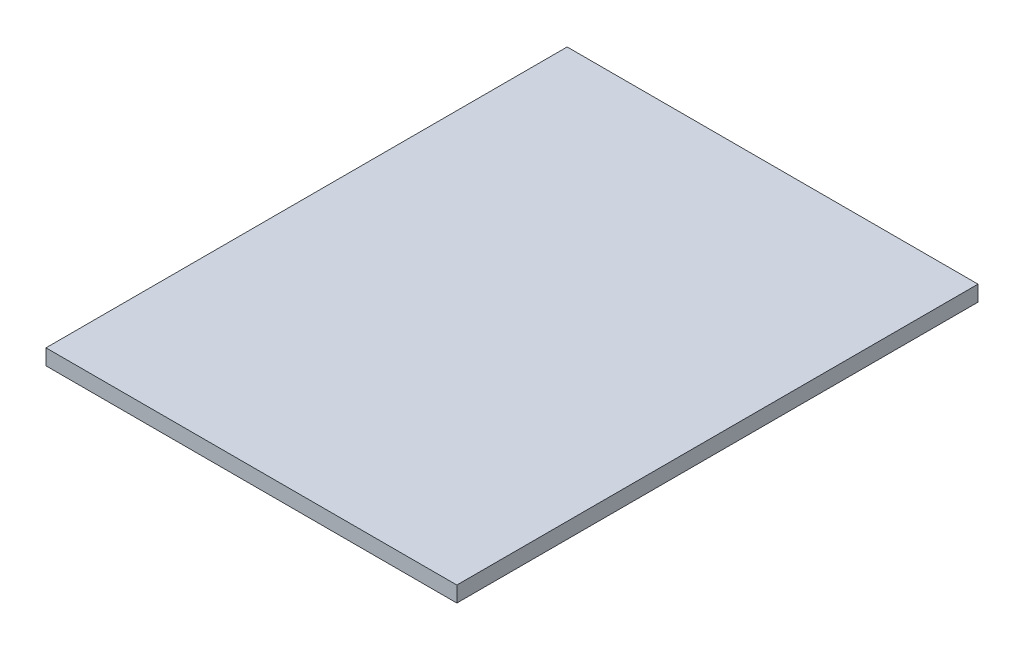
ISO-10303-21;
HEADER;
FILE_DESCRIPTION(('STEP AP214'),'2;1');
FILE_NAME('part.step','',(''),(''),'','','');
FILE_SCHEMA(('AUTOMOTIVE_DESIGN { 1 0 10303 214 1 1 1 1 }'));
ENDSEC;
DATA;
#1=APPLICATION_CONTEXT('core data for automotive mechanical design processes');
#2=APPLICATION_PROTOCOL_DEFINITION('international standard','automotive_design',2000,#1);
#3=PRODUCT_CONTEXT('',#1,'mechanical');
#4=PRODUCT('Part','Part','',(#3));
#5=PRODUCT_RELATED_PRODUCT_CATEGORY('part','',(#4));
#6=PRODUCT_DEFINITION_FORMATION('','',#4);
#7=PRODUCT_DEFINITION_CONTEXT('part definition',#1,'design');
#8=PRODUCT_DEFINITION('design','',#6,#7);
#9=PRODUCT_DEFINITION_SHAPE('','',#8);
#10=(LENGTH_UNIT() NAMED_UNIT(*) SI_UNIT(.MILLI.,.METRE.));
#11=(NAMED_UNIT(*) PLANE_ANGLE_UNIT() SI_UNIT($,.RADIAN.));
#12=(NAMED_UNIT(*) SI_UNIT($,.STERADIAN.) SOLID_ANGLE_UNIT());
#13=UNCERTAINTY_MEASURE_WITH_UNIT(LENGTH_MEASURE(1.E-05),#10,'distance_accuracy_value','');
#14=(GEOMETRIC_REPRESENTATION_CONTEXT(3) GLOBAL_UNCERTAINTY_ASSIGNED_CONTEXT((#13)) GLOBAL_UNIT_ASSIGNED_CONTEXT((#10,
#11,#12)) REPRESENTATION_CONTEXT('',''));
#15=CARTESIAN_POINT('',(0.,0.,0.));
#16=DIRECTION('',(0.,0.,1.));
#17=DIRECTION('',(1.,0.,0.));
#18=AXIS2_PLACEMENT_3D('',#15,#16,#17);
#19=CARTESIAN_POINT('',(0.,18.,0.));
#20=DIRECTION('',(1.,0.,0.));
#21=DIRECTION('',(0.,0.,-1.));
#22=AXIS2_PLACEMENT_3D('',#19,#20,#21);
#23=PLANE('',#22);
#24=DIRECTION('',(0.,0.,1.));
#25=VECTOR('',#24,1.);
#26=CARTESIAN_POINT('',(0.,0.,0.));
#27=LINE('',#26,#25);
#28=CARTESIAN_POINT('',(0.,0.,-600.));
#29=VERTEX_POINT('',#28);
#30=CARTESIAN_POINT('',(0.,0.,0.));
#31=VERTEX_POINT('',#30);
#32=EDGE_CURVE('E98',#29,#31,#27,.T.);
#33=ORIENTED_EDGE('',*,*,#32,.T.);
#34=DIRECTION('',(0.,-1.,0.));
#35=VECTOR('',#34,1.);
#36=CARTESIAN_POINT('',(0.,18.,0.));
#37=LINE('',#36,#35);
#38=CARTESIAN_POINT('',(0.,18.,0.));
#39=VERTEX_POINT('',#38);
#40=EDGE_CURVE('E11',#39,#31,#37,.T.);
#41=ORIENTED_EDGE('',*,*,#40,.F.);
#42=DIRECTION('',(0.,0.,1.));
#43=VECTOR('',#42,1.);
#44=CARTESIAN_POINT('',(0.,18.,0.));
#45=LINE('',#44,#43);
#46=CARTESIAN_POINT('',(0.,18.,-600.));
#47=VERTEX_POINT('',#46);
#48=EDGE_CURVE('E86',#47,#39,#45,.T.);
#49=ORIENTED_EDGE('',*,*,#48,.F.);
#50=DIRECTION('',(0.,-1.,0.));
#51=VECTOR('',#50,1.);
#52=CARTESIAN_POINT('',(0.,18.,-600.));
#53=LINE('',#52,#51);
#54=EDGE_CURVE('E94',#47,#29,#53,.T.);
#55=ORIENTED_EDGE('',*,*,#54,.T.);
#56=EDGE_LOOP('',(#33,#41,#49,#55));
#57=FACE_BOUND('',#56,.T.);
#58=ADVANCED_FACE('F35',(#57),#23,.F.);
#59=CARTESIAN_POINT('',(0.,18.,0.));
#60=DIRECTION('',(0.,0.,-1.));
#61=DIRECTION('',(-1.,0.,0.));
#62=AXIS2_PLACEMENT_3D('',#59,#60,#61);
#63=PLANE('',#62);
#64=DIRECTION('',(1.,0.,0.));
#65=VECTOR('',#64,1.);
#66=CARTESIAN_POINT('',(0.,0.,0.));
#67=LINE('',#66,#65);
#68=CARTESIAN_POINT('',(473.,0.,0.));
#69=VERTEX_POINT('',#68);
#70=EDGE_CURVE('E90',#31,#69,#67,.T.);
#71=ORIENTED_EDGE('',*,*,#70,.T.);
#72=DIRECTION('',(0.,-1.,0.));
#73=VECTOR('',#72,1.);
#74=CARTESIAN_POINT('',(473.,18.,0.));
#75=LINE('',#74,#73);
#76=CARTESIAN_POINT('',(473.,18.,0.));
#77=VERTEX_POINT('',#76);
#78=EDGE_CURVE('E43',#77,#69,#75,.T.);
#79=ORIENTED_EDGE('',*,*,#78,.F.);
#80=DIRECTION('',(1.,0.,0.));
#81=VECTOR('',#80,1.);
#82=CARTESIAN_POINT('',(0.,18.,0.));
#83=LINE('',#82,#81);
#84=EDGE_CURVE('E81',#39,#77,#83,.T.);
#85=ORIENTED_EDGE('',*,*,#84,.F.);
#86=ORIENTED_EDGE('',*,*,#40,.T.);
#87=EDGE_LOOP('',(#71,#79,#85,#86));
#88=FACE_BOUND('',#87,.T.);
#89=ADVANCED_FACE('F89',(#88),#63,.F.);
#90=CARTESIAN_POINT('',(473.,18.,0.));
#91=DIRECTION('',(-1.,0.,0.));
#92=DIRECTION('',(0.,0.,1.));
#93=AXIS2_PLACEMENT_3D('',#90,#91,#92);
#94=PLANE('',#93);
#95=DIRECTION('',(0.,0.,-1.));
#96=VECTOR('',#95,1.);
#97=CARTESIAN_POINT('',(473.,0.,0.));
#98=LINE('',#97,#96);
#99=CARTESIAN_POINT('',(473.,0.,-600.));
#100=VERTEX_POINT('',#99);
#101=EDGE_CURVE('E68',#69,#100,#98,.T.);
#102=ORIENTED_EDGE('',*,*,#101,.T.);
#103=DIRECTION('',(0.,-1.,0.));
#104=VECTOR('',#103,1.);
#105=CARTESIAN_POINT('',(473.,18.,-600.));
#106=LINE('',#105,#104);
#107=CARTESIAN_POINT('',(473.,18.,-600.));
#108=VERTEX_POINT('',#107);
#109=EDGE_CURVE('E91',#108,#100,#106,.T.);
#110=ORIENTED_EDGE('',*,*,#109,.F.);
#111=DIRECTION('',(0.,0.,-1.));
#112=VECTOR('',#111,1.);
#113=CARTESIAN_POINT('',(473.,18.,0.));
#114=LINE('',#113,#112);
#115=EDGE_CURVE('E84',#77,#108,#114,.T.);
#116=ORIENTED_EDGE('',*,*,#115,.F.);
#117=ORIENTED_EDGE('',*,*,#78,.T.);
#118=EDGE_LOOP('',(#102,#110,#116,#117));
#119=FACE_BOUND('',#118,.T.);
#120=ADVANCED_FACE('F92',(#119),#94,.F.);
#121=CARTESIAN_POINT('',(0.,18.,-600.));
#122=DIRECTION('',(0.,0.,1.));
#123=DIRECTION('',(1.,0.,0.));
#124=AXIS2_PLACEMENT_3D('',#121,#122,#123);
#125=PLANE('',#124);
#126=DIRECTION('',(-1.,0.,0.));
#127=VECTOR('',#126,1.);
#128=CARTESIAN_POINT('',(0.,0.,-600.));
#129=LINE('',#128,#127);
#130=EDGE_CURVE('E74',#100,#29,#129,.T.);
#131=ORIENTED_EDGE('',*,*,#130,.T.);
#132=ORIENTED_EDGE('',*,*,#54,.F.);
#133=DIRECTION('',(-1.,0.,0.));
#134=VECTOR('',#133,1.);
#135=CARTESIAN_POINT('',(0.,18.,-600.));
#136=LINE('',#135,#134);
#137=EDGE_CURVE('E51',#108,#47,#136,.T.);
#138=ORIENTED_EDGE('',*,*,#137,.F.);
#139=ORIENTED_EDGE('',*,*,#109,.T.);
#140=EDGE_LOOP('',(#131,#132,#138,#139));
#141=FACE_BOUND('',#140,.T.);
#142=ADVANCED_FACE('F105',(#141),#125,.F.);
#143=CARTESIAN_POINT('',(0.,18.,0.));
#144=DIRECTION('',(0.,-1.,0.));
#145=DIRECTION('',(0.,0.,-1.));
#146=AXIS2_PLACEMENT_3D('',#143,#144,#145);
#147=PLANE('',#146);
#148=ORIENTED_EDGE('',*,*,#48,.T.);
#149=ORIENTED_EDGE('',*,*,#84,.T.);
#150=ORIENTED_EDGE('',*,*,#115,.T.);
#151=ORIENTED_EDGE('',*,*,#137,.T.);
#152=EDGE_LOOP('',(#148,#149,#150,#151));
#153=FACE_BOUND('',#152,.T.);
#154=ADVANCED_FACE('F82',(#153),#147,.F.);
#155=CARTESIAN_POINT('',(0.,0.,0.));
#156=DIRECTION('',(0.,-1.,0.));
#157=DIRECTION('',(0.,0.,-1.));
#158=AXIS2_PLACEMENT_3D('',#155,#156,#157);
#159=PLANE('',#158);
#160=ORIENTED_EDGE('',*,*,#32,.F.);
#161=ORIENTED_EDGE('',*,*,#130,.F.);
#162=ORIENTED_EDGE('',*,*,#101,.F.);
#163=ORIENTED_EDGE('',*,*,#70,.F.);
#164=EDGE_LOOP('',(#160,#161,#162,#163));
#165=FACE_BOUND('',#164,.T.);
#166=ADVANCED_FACE('F108',(#165),#159,.T.);
#167=CLOSED_SHELL('',(#58,#89,#120,#142,#154,#166));
#168=MANIFOLD_SOLID_BREP('B2',#167);
#169=ADVANCED_BREP_SHAPE_REPRESENTATION('',(#18,#168),#14);
#170=SHAPE_DEFINITION_REPRESENTATION(#9,#169);
ENDSEC;
END-ISO-10303-21;
